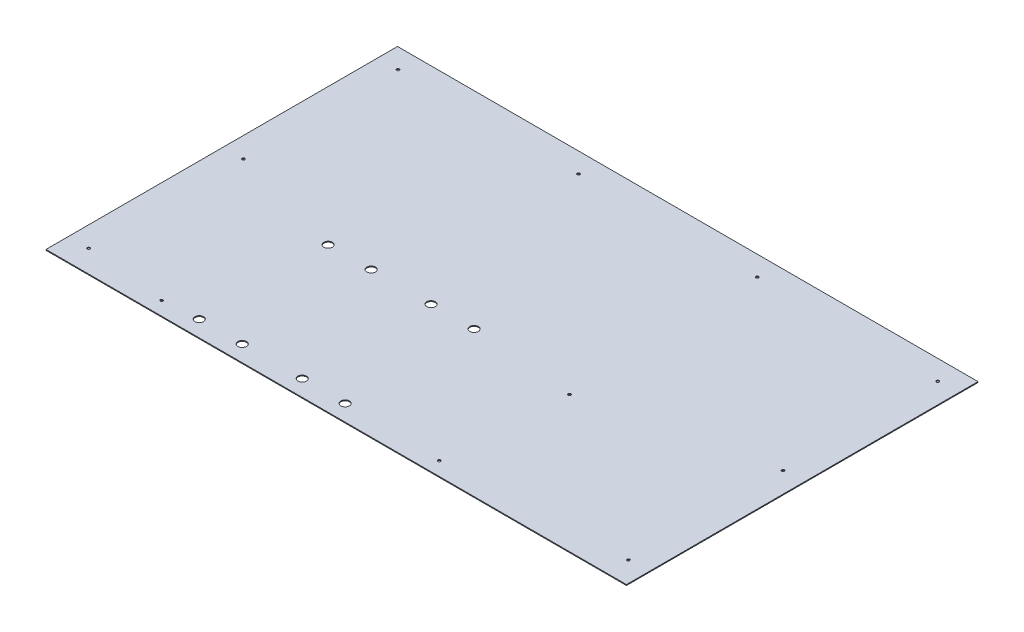
ISO-10303-21;
HEADER;
FILE_DESCRIPTION(('STEP AP214'),'2;1');
FILE_NAME('part.step','',(''),(''),'','','');
FILE_SCHEMA(('AUTOMOTIVE_DESIGN { 1 0 10303 214 1 1 1 1 }'));
ENDSEC;
DATA;
#1=APPLICATION_CONTEXT('core data for automotive mechanical design processes');
#2=APPLICATION_PROTOCOL_DEFINITION('international standard','automotive_design',2000,#1);
#3=PRODUCT_CONTEXT('',#1,'mechanical');
#4=PRODUCT('Part','Part','',(#3));
#5=PRODUCT_RELATED_PRODUCT_CATEGORY('part','',(#4));
#6=PRODUCT_DEFINITION_FORMATION('','',#4);
#7=PRODUCT_DEFINITION_CONTEXT('part definition',#1,'design');
#8=PRODUCT_DEFINITION('design','',#6,#7);
#9=PRODUCT_DEFINITION_SHAPE('','',#8);
#10=(LENGTH_UNIT() NAMED_UNIT(*) SI_UNIT(.MILLI.,.METRE.));
#11=(NAMED_UNIT(*) PLANE_ANGLE_UNIT() SI_UNIT($,.RADIAN.));
#12=(NAMED_UNIT(*) SI_UNIT($,.STERADIAN.) SOLID_ANGLE_UNIT());
#13=UNCERTAINTY_MEASURE_WITH_UNIT(LENGTH_MEASURE(1.E-05),#10,'distance_accuracy_value','');
#14=(GEOMETRIC_REPRESENTATION_CONTEXT(3) GLOBAL_UNCERTAINTY_ASSIGNED_CONTEXT((#13)) GLOBAL_UNIT_ASSIGNED_CONTEXT((#10,
#11,#12)) REPRESENTATION_CONTEXT('',''));
#15=CARTESIAN_POINT('',(0.,0.,0.));
#16=DIRECTION('',(0.,0.,1.));
#17=DIRECTION('',(1.,0.,0.));
#18=AXIS2_PLACEMENT_3D('',#15,#16,#17);
#19=CARTESIAN_POINT('',(337.7,1.,204.5));
#20=DIRECTION('',(-1.,0.,0.));
#21=DIRECTION('',(0.,0.,1.));
#22=AXIS2_PLACEMENT_3D('',#19,#20,#21);
#23=PLANE('',#22);
#24=DIRECTION('',(0.,0.,-1.));
#25=VECTOR('',#24,1.);
#26=CARTESIAN_POINT('',(337.7,0.,204.5));
#27=LINE('',#26,#25);
#28=CARTESIAN_POINT('',(337.7,0.,204.5));
#29=VERTEX_POINT('',#28);
#30=CARTESIAN_POINT('',(337.7,0.,-204.5));
#31=VERTEX_POINT('',#30);
#32=EDGE_CURVE('E96',#29,#31,#27,.T.);
#33=ORIENTED_EDGE('',*,*,#32,.T.);
#34=DIRECTION('',(0.,-1.,0.));
#35=VECTOR('',#34,1.);
#36=CARTESIAN_POINT('',(337.7,1.,-204.5));
#37=LINE('',#36,#35);
#38=CARTESIAN_POINT('',(337.7,1.,-204.5));
#39=VERTEX_POINT('',#38);
#40=EDGE_CURVE('E11',#39,#31,#37,.T.);
#41=ORIENTED_EDGE('',*,*,#40,.F.);
#42=DIRECTION('',(0.,0.,-1.));
#43=VECTOR('',#42,1.);
#44=CARTESIAN_POINT('',(337.7,1.,204.5));
#45=LINE('',#44,#43);
#46=CARTESIAN_POINT('',(337.7,1.,204.5));
#47=VERTEX_POINT('',#46);
#48=EDGE_CURVE('E84',#47,#39,#45,.T.);
#49=ORIENTED_EDGE('',*,*,#48,.F.);
#50=DIRECTION('',(0.,-1.,0.));
#51=VECTOR('',#50,1.);
#52=CARTESIAN_POINT('',(337.7,1.,204.5));
#53=LINE('',#52,#51);
#54=EDGE_CURVE('E92',#47,#29,#53,.T.);
#55=ORIENTED_EDGE('',*,*,#54,.T.);
#56=EDGE_LOOP('',(#33,#41,#49,#55));
#57=FACE_BOUND('',#56,.T.);
#58=ADVANCED_FACE('F33',(#57),#23,.F.);
#59=CARTESIAN_POINT('',(-337.7,1.,-204.5));
#60=DIRECTION('',(0.,0.,1.));
#61=DIRECTION('',(1.,0.,0.));
#62=AXIS2_PLACEMENT_3D('',#59,#60,#61);
#63=PLANE('',#62);
#64=DIRECTION('',(-1.,0.,0.));
#65=VECTOR('',#64,1.);
#66=CARTESIAN_POINT('',(-337.7,0.,-204.5));
#67=LINE('',#66,#65);
#68=CARTESIAN_POINT('',(-337.7,0.,-204.5));
#69=VERTEX_POINT('',#68);
#70=EDGE_CURVE('E88',#31,#69,#67,.T.);
#71=ORIENTED_EDGE('',*,*,#70,.T.);
#72=DIRECTION('',(0.,-1.,0.));
#73=VECTOR('',#72,1.);
#74=CARTESIAN_POINT('',(-337.7,1.,-204.5));
#75=LINE('',#74,#73);
#76=CARTESIAN_POINT('',(-337.7,1.,-204.5));
#77=VERTEX_POINT('',#76);
#78=EDGE_CURVE('E41',#77,#69,#75,.T.);
#79=ORIENTED_EDGE('',*,*,#78,.F.);
#80=DIRECTION('',(-1.,0.,0.));
#81=VECTOR('',#80,1.);
#82=CARTESIAN_POINT('',(-337.7,1.,-204.5));
#83=LINE('',#82,#81);
#84=EDGE_CURVE('E79',#39,#77,#83,.T.);
#85=ORIENTED_EDGE('',*,*,#84,.F.);
#86=ORIENTED_EDGE('',*,*,#40,.T.);
#87=EDGE_LOOP('',(#71,#79,#85,#86));
#88=FACE_BOUND('',#87,.T.);
#89=ADVANCED_FACE('F87',(#88),#63,.F.);
#90=CARTESIAN_POINT('',(-337.7,1.,204.5));
#91=DIRECTION('',(1.,0.,0.));
#92=DIRECTION('',(0.,0.,-1.));
#93=AXIS2_PLACEMENT_3D('',#90,#91,#92);
#94=PLANE('',#93);
#95=DIRECTION('',(0.,0.,1.));
#96=VECTOR('',#95,1.);
#97=CARTESIAN_POINT('',(-337.7,0.,204.5));
#98=LINE('',#97,#96);
#99=CARTESIAN_POINT('',(-337.7,0.,204.5));
#100=VERTEX_POINT('',#99);
#101=EDGE_CURVE('E66',#69,#100,#98,.T.);
#102=ORIENTED_EDGE('',*,*,#101,.T.);
#103=DIRECTION('',(0.,-1.,0.));
#104=VECTOR('',#103,1.);
#105=CARTESIAN_POINT('',(-337.7,1.,204.5));
#106=LINE('',#105,#104);
#107=CARTESIAN_POINT('',(-337.7,1.,204.5));
#108=VERTEX_POINT('',#107);
#109=EDGE_CURVE('E89',#108,#100,#106,.T.);
#110=ORIENTED_EDGE('',*,*,#109,.F.);
#111=DIRECTION('',(0.,0.,1.));
#112=VECTOR('',#111,1.);
#113=CARTESIAN_POINT('',(-337.7,1.,204.5));
#114=LINE('',#113,#112);
#115=EDGE_CURVE('E82',#77,#108,#114,.T.);
#116=ORIENTED_EDGE('',*,*,#115,.F.);
#117=ORIENTED_EDGE('',*,*,#78,.T.);
#118=EDGE_LOOP('',(#102,#110,#116,#117));
#119=FACE_BOUND('',#118,.T.);
#120=ADVANCED_FACE('F90',(#119),#94,.F.);
#121=CARTESIAN_POINT('',(-337.7,1.,204.5));
#122=DIRECTION('',(0.,0.,-1.));
#123=DIRECTION('',(-1.,0.,0.));
#124=AXIS2_PLACEMENT_3D('',#121,#122,#123);
#125=PLANE('',#124);
#126=DIRECTION('',(1.,0.,0.));
#127=VECTOR('',#126,1.);
#128=CARTESIAN_POINT('',(-337.7,0.,204.5));
#129=LINE('',#128,#127);
#130=EDGE_CURVE('E72',#100,#29,#129,.T.);
#131=ORIENTED_EDGE('',*,*,#130,.T.);
#132=ORIENTED_EDGE('',*,*,#54,.F.);
#133=DIRECTION('',(1.,0.,0.));
#134=VECTOR('',#133,1.);
#135=CARTESIAN_POINT('',(-337.7,1.,204.5));
#136=LINE('',#135,#134);
#137=EDGE_CURVE('E49',#108,#47,#136,.T.);
#138=ORIENTED_EDGE('',*,*,#137,.F.);
#139=ORIENTED_EDGE('',*,*,#109,.T.);
#140=EDGE_LOOP('',(#131,#132,#138,#139));
#141=FACE_BOUND('',#140,.T.);
#142=ADVANCED_FACE('F104',(#141),#125,.F.);
#143=CARTESIAN_POINT('',(0.,1.,0.));
#144=DIRECTION('',(0.,-1.,0.));
#145=DIRECTION('',(0.,0.,-1.));
#146=AXIS2_PLACEMENT_3D('',#143,#144,#145);
#147=PLANE('',#146);
#148=CARTESIAN_POINT('',(-104.,1.,-181.4));
#149=DIRECTION('',(0.,-1.,0.));
#150=DIRECTION('',(0.,0.,-1.));
#151=AXIS2_PLACEMENT_3D('',#148,#149,#150);
#152=CIRCLE('',#151,1.59999999999996);
#153=CARTESIAN_POINT('',(-104.,1.,-183.));
#154=VERTEX_POINT('',#153);
#155=EDGE_CURVE('E217',#154,#154,#152,.F.);
#156=ORIENTED_EDGE('',*,*,#155,.F.);
#157=EDGE_LOOP('',(#156));
#158=FACE_BOUND('',#157,.T.);
#159=CARTESIAN_POINT('',(104.,1.,188.6));
#160=DIRECTION('',(0.,-1.,0.));
#161=DIRECTION('',(0.,0.,-1.));
#162=AXIS2_PLACEMENT_3D('',#159,#160,#161);
#163=CIRCLE('',#162,1.60000000000002);
#164=CARTESIAN_POINT('',(104.,1.,187.));
#165=VERTEX_POINT('',#164);
#166=EDGE_CURVE('E211',#165,#165,#163,.F.);
#167=ORIENTED_EDGE('',*,*,#166,.F.);
#168=EDGE_LOOP('',(#167));
#169=FACE_BOUND('',#168,.T.);
#170=CARTESIAN_POINT('',(104.,1.,-181.4));
#171=DIRECTION('',(0.,-1.,0.));
#172=DIRECTION('',(0.,0.,-1.));
#173=AXIS2_PLACEMENT_3D('',#170,#171,#172);
#174=CIRCLE('',#173,1.59999999999999);
#175=CARTESIAN_POINT('',(104.,1.,-183.));
#176=VERTEX_POINT('',#175);
#177=EDGE_CURVE('E205',#176,#176,#174,.F.);
#178=ORIENTED_EDGE('',*,*,#177,.F.);
#179=EDGE_LOOP('',(#178));
#180=FACE_BOUND('',#179,.T.);
#181=CARTESIAN_POINT('',(-219.,1.,188.6));
#182=DIRECTION('',(0.,-1.,0.));
#183=DIRECTION('',(0.,0.,-1.));
#184=AXIS2_PLACEMENT_3D('',#181,#182,#183);
#185=CIRCLE('',#184,1.59999999999999);
#186=CARTESIAN_POINT('',(-219.,1.,187.));
#187=VERTEX_POINT('',#186);
#188=EDGE_CURVE('E199',#187,#187,#185,.F.);
#189=ORIENTED_EDGE('',*,*,#188,.F.);
#190=EDGE_LOOP('',(#189));
#191=FACE_BOUND('',#190,.T.);
#192=CARTESIAN_POINT('',(314.,1.,-1.3999999999999));
#193=DIRECTION('',(0.,-1.,0.));
#194=DIRECTION('',(0.,0.,-1.));
#195=AXIS2_PLACEMENT_3D('',#192,#193,#194);
#196=CIRCLE('',#195,1.59999999999996);
#197=CARTESIAN_POINT('',(314.,1.,-2.99999999999987));
#198=VERTEX_POINT('',#197);
#199=EDGE_CURVE('E193',#198,#198,#196,.F.);
#200=ORIENTED_EDGE('',*,*,#199,.F.);
#201=EDGE_LOOP('',(#200));
#202=FACE_BOUND('',#201,.T.);
#203=CARTESIAN_POINT('',(-314.,1.,-1.40000000000004));
#204=DIRECTION('',(0.,-1.,0.));
#205=DIRECTION('',(0.,0.,-1.));
#206=AXIS2_PLACEMENT_3D('',#203,#204,#205);
#207=CIRCLE('',#206,1.59999999999996);
#208=CARTESIAN_POINT('',(-314.,1.,-3.));
#209=VERTEX_POINT('',#208);
#210=EDGE_CURVE('E187',#209,#209,#207,.F.);
#211=ORIENTED_EDGE('',*,*,#210,.F.);
#212=EDGE_LOOP('',(#211));
#213=FACE_BOUND('',#212,.T.);
#214=CARTESIAN_POINT('',(-128.3,1.,35.6));
#215=DIRECTION('',(0.,-1.,0.));
#216=DIRECTION('',(0.,0.,-1.));
#217=AXIS2_PLACEMENT_3D('',#214,#215,#216);
#218=CIRCLE('',#217,4.99999999999999);
#219=CARTESIAN_POINT('',(-128.3,1.,30.6));
#220=VERTEX_POINT('',#219);
#221=EDGE_CURVE('E181',#220,#220,#218,.F.);
#222=ORIENTED_EDGE('',*,*,#221,.F.);
#223=EDGE_LOOP('',(#222));
#224=FACE_BOUND('',#223,.T.);
#225=CARTESIAN_POINT('',(-178.3,1.,35.6));
#226=DIRECTION('',(0.,-1.,0.));
#227=DIRECTION('',(0.,0.,-1.));
#228=AXIS2_PLACEMENT_3D('',#225,#226,#227);
#229=CIRCLE('',#228,4.99999999999999);
#230=CARTESIAN_POINT('',(-178.3,1.,30.6));
#231=VERTEX_POINT('',#230);
#232=EDGE_CURVE('E175',#231,#231,#229,.F.);
#233=ORIENTED_EDGE('',*,*,#232,.F.);
#234=EDGE_LOOP('',(#233));
#235=FACE_BOUND('',#234,.T.);
#236=CARTESIAN_POINT('',(-178.3,1.,185.6));
#237=DIRECTION('',(0.,-1.,0.));
#238=DIRECTION('',(0.,0.,-1.));
#239=AXIS2_PLACEMENT_3D('',#236,#237,#238);
#240=CIRCLE('',#239,4.99999999999999);
#241=CARTESIAN_POINT('',(-178.3,1.,180.6));
#242=VERTEX_POINT('',#241);
#243=EDGE_CURVE('E169',#242,#242,#240,.F.);
#244=ORIENTED_EDGE('',*,*,#243,.F.);
#245=EDGE_LOOP('',(#244));
#246=FACE_BOUND('',#245,.T.);
#247=CARTESIAN_POINT('',(-128.3,1.,185.6));
#248=DIRECTION('',(0.,-1.,0.));
#249=DIRECTION('',(0.,0.,-1.));
#250=AXIS2_PLACEMENT_3D('',#247,#248,#249);
#251=CIRCLE('',#250,5.00000000000002);
#252=CARTESIAN_POINT('',(-128.3,1.,180.6));
#253=VERTEX_POINT('',#252);
#254=EDGE_CURVE('E163',#253,#253,#251,.F.);
#255=ORIENTED_EDGE('',*,*,#254,.F.);
#256=EDGE_LOOP('',(#255));
#257=FACE_BOUND('',#256,.T.);
#258=CARTESIAN_POINT('',(-58.5,1.,185.6));
#259=DIRECTION('',(0.,-1.,0.));
#260=DIRECTION('',(0.,0.,-1.));
#261=AXIS2_PLACEMENT_3D('',#258,#259,#260);
#262=CIRCLE('',#261,5.00000000000002);
#263=CARTESIAN_POINT('',(-58.5,1.,180.6));
#264=VERTEX_POINT('',#263);
#265=EDGE_CURVE('E157',#264,#264,#262,.F.);
#266=ORIENTED_EDGE('',*,*,#265,.F.);
#267=EDGE_LOOP('',(#266));
#268=FACE_BOUND('',#267,.T.);
#269=CARTESIAN_POINT('',(-8.49999999999999,1.,185.6));
#270=DIRECTION('',(0.,-1.,0.));
#271=DIRECTION('',(0.,0.,-1.));
#272=AXIS2_PLACEMENT_3D('',#269,#270,#271);
#273=CIRCLE('',#272,5.00000000000001);
#274=CARTESIAN_POINT('',(-8.49999999999999,1.,180.6));
#275=VERTEX_POINT('',#274);
#276=EDGE_CURVE('E151',#275,#275,#273,.F.);
#277=ORIENTED_EDGE('',*,*,#276,.F.);
#278=EDGE_LOOP('',(#277));
#279=FACE_BOUND('',#278,.T.);
#280=CARTESIAN_POINT('',(-8.49999999999999,1.,35.6));
#281=DIRECTION('',(0.,-1.,0.));
#282=DIRECTION('',(0.,0.,-1.));
#283=AXIS2_PLACEMENT_3D('',#280,#281,#282);
#284=CIRCLE('',#283,4.99999999999999);
#285=CARTESIAN_POINT('',(-8.49999999999999,1.,30.6));
#286=VERTEX_POINT('',#285);
#287=EDGE_CURVE('E145',#286,#286,#284,.F.);
#288=ORIENTED_EDGE('',*,*,#287,.F.);
#289=EDGE_LOOP('',(#288));
#290=FACE_BOUND('',#289,.T.);
#291=CARTESIAN_POINT('',(-58.5,1.,35.6));
#292=DIRECTION('',(0.,-1.,0.));
#293=DIRECTION('',(0.,0.,-1.));
#294=AXIS2_PLACEMENT_3D('',#291,#292,#293);
#295=CIRCLE('',#294,4.99999999999999);
#296=CARTESIAN_POINT('',(-58.5,1.,30.6));
#297=VERTEX_POINT('',#296);
#298=EDGE_CURVE('E139',#297,#297,#295,.F.);
#299=ORIENTED_EDGE('',*,*,#298,.F.);
#300=EDGE_LOOP('',(#299));
#301=FACE_BOUND('',#300,.T.);
#302=CARTESIAN_POINT('',(113.,1.,46.25));
#303=DIRECTION('',(0.,-1.,0.));
#304=DIRECTION('',(0.,0.,-1.));
#305=AXIS2_PLACEMENT_3D('',#302,#303,#304);
#306=CIRCLE('',#305,1.60000000000001);
#307=CARTESIAN_POINT('',(113.,1.,44.65));
#308=VERTEX_POINT('',#307);
#309=EDGE_CURVE('E133',#308,#308,#306,.F.);
#310=ORIENTED_EDGE('',*,*,#309,.F.);
#311=EDGE_LOOP('',(#310));
#312=FACE_BOUND('',#311,.T.);
#313=CARTESIAN_POINT('',(314.,1.,178.6));
#314=DIRECTION('',(0.,-1.,0.));
#315=DIRECTION('',(0.,0.,-1.));
#316=AXIS2_PLACEMENT_3D('',#313,#314,#315);
#317=CIRCLE('',#316,1.59999999999996);
#318=CARTESIAN_POINT('',(314.,1.,177.));
#319=VERTEX_POINT('',#318);
#320=EDGE_CURVE('E127',#319,#319,#317,.F.);
#321=ORIENTED_EDGE('',*,*,#320,.F.);
#322=EDGE_LOOP('',(#321));
#323=FACE_BOUND('',#322,.T.);
#324=CARTESIAN_POINT('',(314.,1.,-181.4));
#325=DIRECTION('',(0.,-1.,0.));
#326=DIRECTION('',(0.,0.,-1.));
#327=AXIS2_PLACEMENT_3D('',#324,#325,#326);
#328=CIRCLE('',#327,1.59999999999996);
#329=CARTESIAN_POINT('',(314.,1.,-183.));
#330=VERTEX_POINT('',#329);
#331=EDGE_CURVE('E121',#330,#330,#328,.F.);
#332=ORIENTED_EDGE('',*,*,#331,.F.);
#333=EDGE_LOOP('',(#332));
#334=FACE_BOUND('',#333,.T.);
#335=CARTESIAN_POINT('',(-314.,1.,-181.4));
#336=DIRECTION('',(0.,-1.,0.));
#337=DIRECTION('',(0.,0.,-1.));
#338=AXIS2_PLACEMENT_3D('',#335,#336,#337);
#339=CIRCLE('',#338,1.59999999999996);
#340=CARTESIAN_POINT('',(-314.,1.,-183.));
#341=VERTEX_POINT('',#340);
#342=EDGE_CURVE('E115',#341,#341,#339,.F.);
#343=ORIENTED_EDGE('',*,*,#342,.F.);
#344=EDGE_LOOP('',(#343));
#345=FACE_BOUND('',#344,.T.);
#346=CARTESIAN_POINT('',(-314.,1.,178.6));
#347=DIRECTION('',(0.,-1.,0.));
#348=DIRECTION('',(0.,0.,-1.));
#349=AXIS2_PLACEMENT_3D('',#346,#347,#348);
#350=CIRCLE('',#349,1.59999999999996);
#351=CARTESIAN_POINT('',(-314.,1.,177.));
#352=VERTEX_POINT('',#351);
#353=EDGE_CURVE('E99',#352,#352,#350,.F.);
#354=ORIENTED_EDGE('',*,*,#353,.F.);
#355=EDGE_LOOP('',(#354));
#356=FACE_BOUND('',#355,.T.);
#357=ORIENTED_EDGE('',*,*,#48,.T.);
#358=ORIENTED_EDGE('',*,*,#84,.T.);
#359=ORIENTED_EDGE('',*,*,#115,.T.);
#360=ORIENTED_EDGE('',*,*,#137,.T.);
#361=EDGE_LOOP('',(#357,#358,#359,#360));
#362=FACE_BOUND('',#361,.T.);
#363=ADVANCED_FACE('F80',(#158,#169,#180,#191,#202,#213,#224,#235,#246,#257,#268,#279,#290,#301,
#312,#323,#334,#345,#356,#362),#147,.F.);
#364=CARTESIAN_POINT('',(0.,0.,0.));
#365=DIRECTION('',(0.,-1.,0.));
#366=DIRECTION('',(0.,0.,-1.));
#367=AXIS2_PLACEMENT_3D('',#364,#365,#366);
#368=PLANE('',#367);
#369=CARTESIAN_POINT('',(-104.,0.,-181.4));
#370=DIRECTION('',(0.,-1.,0.));
#371=DIRECTION('',(0.,0.,-1.));
#372=AXIS2_PLACEMENT_3D('',#369,#370,#371);
#373=CIRCLE('',#372,1.59999999999996);
#374=CARTESIAN_POINT('',(-104.,0.,-183.));
#375=VERTEX_POINT('',#374);
#376=EDGE_CURVE('E220',#375,#375,#373,.T.);
#377=ORIENTED_EDGE('',*,*,#376,.F.);
#378=EDGE_LOOP('',(#377));
#379=FACE_BOUND('',#378,.T.);
#380=CARTESIAN_POINT('',(104.,0.,188.6));
#381=DIRECTION('',(0.,-1.,0.));
#382=DIRECTION('',(0.,0.,-1.));
#383=AXIS2_PLACEMENT_3D('',#380,#381,#382);
#384=CIRCLE('',#383,1.60000000000002);
#385=CARTESIAN_POINT('',(104.,0.,187.));
#386=VERTEX_POINT('',#385);
#387=EDGE_CURVE('E214',#386,#386,#384,.T.);
#388=ORIENTED_EDGE('',*,*,#387,.F.);
#389=EDGE_LOOP('',(#388));
#390=FACE_BOUND('',#389,.T.);
#391=CARTESIAN_POINT('',(104.,0.,-181.4));
#392=DIRECTION('',(0.,-1.,0.));
#393=DIRECTION('',(0.,0.,-1.));
#394=AXIS2_PLACEMENT_3D('',#391,#392,#393);
#395=CIRCLE('',#394,1.59999999999999);
#396=CARTESIAN_POINT('',(104.,0.,-183.));
#397=VERTEX_POINT('',#396);
#398=EDGE_CURVE('E208',#397,#397,#395,.T.);
#399=ORIENTED_EDGE('',*,*,#398,.F.);
#400=EDGE_LOOP('',(#399));
#401=FACE_BOUND('',#400,.T.);
#402=CARTESIAN_POINT('',(-219.,0.,188.6));
#403=DIRECTION('',(0.,-1.,0.));
#404=DIRECTION('',(0.,0.,-1.));
#405=AXIS2_PLACEMENT_3D('',#402,#403,#404);
#406=CIRCLE('',#405,1.59999999999999);
#407=CARTESIAN_POINT('',(-219.,0.,187.));
#408=VERTEX_POINT('',#407);
#409=EDGE_CURVE('E202',#408,#408,#406,.T.);
#410=ORIENTED_EDGE('',*,*,#409,.F.);
#411=EDGE_LOOP('',(#410));
#412=FACE_BOUND('',#411,.T.);
#413=CARTESIAN_POINT('',(314.,0.,-1.3999999999999));
#414=DIRECTION('',(0.,-1.,0.));
#415=DIRECTION('',(0.,0.,-1.));
#416=AXIS2_PLACEMENT_3D('',#413,#414,#415);
#417=CIRCLE('',#416,1.59999999999996);
#418=CARTESIAN_POINT('',(314.,0.,-2.99999999999987));
#419=VERTEX_POINT('',#418);
#420=EDGE_CURVE('E196',#419,#419,#417,.T.);
#421=ORIENTED_EDGE('',*,*,#420,.F.);
#422=EDGE_LOOP('',(#421));
#423=FACE_BOUND('',#422,.T.);
#424=CARTESIAN_POINT('',(-314.,0.,-1.40000000000004));
#425=DIRECTION('',(0.,-1.,0.));
#426=DIRECTION('',(0.,0.,-1.));
#427=AXIS2_PLACEMENT_3D('',#424,#425,#426);
#428=CIRCLE('',#427,1.59999999999996);
#429=CARTESIAN_POINT('',(-314.,0.,-3.));
#430=VERTEX_POINT('',#429);
#431=EDGE_CURVE('E190',#430,#430,#428,.T.);
#432=ORIENTED_EDGE('',*,*,#431,.F.);
#433=EDGE_LOOP('',(#432));
#434=FACE_BOUND('',#433,.T.);
#435=CARTESIAN_POINT('',(-128.3,0.,35.6));
#436=DIRECTION('',(0.,-1.,0.));
#437=DIRECTION('',(0.,0.,1.));
#438=AXIS2_PLACEMENT_3D('',#435,#436,#437);
#439=CIRCLE('',#438,4.99999999999999);
#440=CARTESIAN_POINT('',(-128.3,0.,40.6));
#441=VERTEX_POINT('',#440);
#442=EDGE_CURVE('E184',#441,#441,#439,.T.);
#443=ORIENTED_EDGE('',*,*,#442,.F.);
#444=EDGE_LOOP('',(#443));
#445=FACE_BOUND('',#444,.T.);
#446=CARTESIAN_POINT('',(-178.3,0.,35.6));
#447=DIRECTION('',(0.,-1.,0.));
#448=DIRECTION('',(0.,0.,1.));
#449=AXIS2_PLACEMENT_3D('',#446,#447,#448);
#450=CIRCLE('',#449,4.99999999999999);
#451=CARTESIAN_POINT('',(-178.3,0.,40.6));
#452=VERTEX_POINT('',#451);
#453=EDGE_CURVE('E178',#452,#452,#450,.T.);
#454=ORIENTED_EDGE('',*,*,#453,.F.);
#455=EDGE_LOOP('',(#454));
#456=FACE_BOUND('',#455,.T.);
#457=CARTESIAN_POINT('',(-178.3,0.,185.6));
#458=DIRECTION('',(0.,-1.,0.));
#459=DIRECTION('',(0.,0.,1.));
#460=AXIS2_PLACEMENT_3D('',#457,#458,#459);
#461=CIRCLE('',#460,4.99999999999999);
#462=CARTESIAN_POINT('',(-178.3,0.,190.6));
#463=VERTEX_POINT('',#462);
#464=EDGE_CURVE('E172',#463,#463,#461,.T.);
#465=ORIENTED_EDGE('',*,*,#464,.F.);
#466=EDGE_LOOP('',(#465));
#467=FACE_BOUND('',#466,.T.);
#468=CARTESIAN_POINT('',(-128.3,0.,185.6));
#469=DIRECTION('',(0.,-1.,0.));
#470=DIRECTION('',(0.,0.,1.));
#471=AXIS2_PLACEMENT_3D('',#468,#469,#470);
#472=CIRCLE('',#471,5.00000000000002);
#473=CARTESIAN_POINT('',(-128.3,0.,190.6));
#474=VERTEX_POINT('',#473);
#475=EDGE_CURVE('E166',#474,#474,#472,.T.);
#476=ORIENTED_EDGE('',*,*,#475,.F.);
#477=EDGE_LOOP('',(#476));
#478=FACE_BOUND('',#477,.T.);
#479=CARTESIAN_POINT('',(-58.5,0.,185.6));
#480=DIRECTION('',(0.,-1.,0.));
#481=DIRECTION('',(0.,0.,-1.));
#482=AXIS2_PLACEMENT_3D('',#479,#480,#481);
#483=CIRCLE('',#482,5.00000000000002);
#484=CARTESIAN_POINT('',(-58.5,0.,180.6));
#485=VERTEX_POINT('',#484);
#486=EDGE_CURVE('E160',#485,#485,#483,.T.);
#487=ORIENTED_EDGE('',*,*,#486,.F.);
#488=EDGE_LOOP('',(#487));
#489=FACE_BOUND('',#488,.T.);
#490=CARTESIAN_POINT('',(-8.49999999999999,0.,185.6));
#491=DIRECTION('',(0.,-1.,0.));
#492=DIRECTION('',(0.,0.,-1.));
#493=AXIS2_PLACEMENT_3D('',#490,#491,#492);
#494=CIRCLE('',#493,5.00000000000001);
#495=CARTESIAN_POINT('',(-8.49999999999999,0.,180.6));
#496=VERTEX_POINT('',#495);
#497=EDGE_CURVE('E154',#496,#496,#494,.T.);
#498=ORIENTED_EDGE('',*,*,#497,.F.);
#499=EDGE_LOOP('',(#498));
#500=FACE_BOUND('',#499,.T.);
#501=CARTESIAN_POINT('',(-8.49999999999999,0.,35.6));
#502=DIRECTION('',(0.,-1.,0.));
#503=DIRECTION('',(0.,0.,-1.));
#504=AXIS2_PLACEMENT_3D('',#501,#502,#503);
#505=CIRCLE('',#504,4.99999999999999);
#506=CARTESIAN_POINT('',(-8.49999999999999,0.,30.6));
#507=VERTEX_POINT('',#506);
#508=EDGE_CURVE('E148',#507,#507,#505,.T.);
#509=ORIENTED_EDGE('',*,*,#508,.F.);
#510=EDGE_LOOP('',(#509));
#511=FACE_BOUND('',#510,.T.);
#512=CARTESIAN_POINT('',(-58.5,0.,35.6));
#513=DIRECTION('',(0.,-1.,0.));
#514=DIRECTION('',(0.,0.,-1.));
#515=AXIS2_PLACEMENT_3D('',#512,#513,#514);
#516=CIRCLE('',#515,4.99999999999999);
#517=CARTESIAN_POINT('',(-58.5,0.,30.6));
#518=VERTEX_POINT('',#517);
#519=EDGE_CURVE('E142',#518,#518,#516,.T.);
#520=ORIENTED_EDGE('',*,*,#519,.F.);
#521=EDGE_LOOP('',(#520));
#522=FACE_BOUND('',#521,.T.);
#523=CARTESIAN_POINT('',(113.,0.,46.25));
#524=DIRECTION('',(0.,-1.,0.));
#525=DIRECTION('',(0.,0.,-1.));
#526=AXIS2_PLACEMENT_3D('',#523,#524,#525);
#527=CIRCLE('',#526,1.60000000000001);
#528=CARTESIAN_POINT('',(113.,0.,44.65));
#529=VERTEX_POINT('',#528);
#530=EDGE_CURVE('E136',#529,#529,#527,.T.);
#531=ORIENTED_EDGE('',*,*,#530,.F.);
#532=EDGE_LOOP('',(#531));
#533=FACE_BOUND('',#532,.T.);
#534=CARTESIAN_POINT('',(314.,0.,178.6));
#535=DIRECTION('',(0.,-1.,0.));
#536=DIRECTION('',(0.,0.,-1.));
#537=AXIS2_PLACEMENT_3D('',#534,#535,#536);
#538=CIRCLE('',#537,1.59999999999996);
#539=CARTESIAN_POINT('',(314.,0.,177.));
#540=VERTEX_POINT('',#539);
#541=EDGE_CURVE('E130',#540,#540,#538,.T.);
#542=ORIENTED_EDGE('',*,*,#541,.F.);
#543=EDGE_LOOP('',(#542));
#544=FACE_BOUND('',#543,.T.);
#545=CARTESIAN_POINT('',(314.,0.,-181.4));
#546=DIRECTION('',(0.,-1.,0.));
#547=DIRECTION('',(0.,0.,-1.));
#548=AXIS2_PLACEMENT_3D('',#545,#546,#547);
#549=CIRCLE('',#548,1.59999999999996);
#550=CARTESIAN_POINT('',(314.,0.,-183.));
#551=VERTEX_POINT('',#550);
#552=EDGE_CURVE('E124',#551,#551,#549,.T.);
#553=ORIENTED_EDGE('',*,*,#552,.F.);
#554=EDGE_LOOP('',(#553));
#555=FACE_BOUND('',#554,.T.);
#556=CARTESIAN_POINT('',(-314.,0.,-181.4));
#557=DIRECTION('',(0.,-1.,0.));
#558=DIRECTION('',(0.,0.,-1.));
#559=AXIS2_PLACEMENT_3D('',#556,#557,#558);
#560=CIRCLE('',#559,1.59999999999996);
#561=CARTESIAN_POINT('',(-314.,0.,-183.));
#562=VERTEX_POINT('',#561);
#563=EDGE_CURVE('E118',#562,#562,#560,.T.);
#564=ORIENTED_EDGE('',*,*,#563,.F.);
#565=EDGE_LOOP('',(#564));
#566=FACE_BOUND('',#565,.T.);
#567=CARTESIAN_POINT('',(-314.,0.,178.6));
#568=DIRECTION('',(0.,-1.,0.));
#569=DIRECTION('',(0.,0.,-1.));
#570=AXIS2_PLACEMENT_3D('',#567,#568,#569);
#571=CIRCLE('',#570,1.59999999999996);
#572=CARTESIAN_POINT('',(-314.,0.,177.));
#573=VERTEX_POINT('',#572);
#574=EDGE_CURVE('E112',#573,#573,#571,.T.);
#575=ORIENTED_EDGE('',*,*,#574,.F.);
#576=EDGE_LOOP('',(#575));
#577=FACE_BOUND('',#576,.T.);
#578=ORIENTED_EDGE('',*,*,#32,.F.);
#579=ORIENTED_EDGE('',*,*,#130,.F.);
#580=ORIENTED_EDGE('',*,*,#101,.F.);
#581=ORIENTED_EDGE('',*,*,#70,.F.);
#582=EDGE_LOOP('',(#578,#579,#580,#581));
#583=FACE_BOUND('',#582,.T.);
#584=ADVANCED_FACE('F107',(#379,#390,#401,#412,#423,#434,#445,#456,#467,#478,#489,#500,#511,
#522,#533,#544,#555,#566,#577,#583),#368,.T.);
#585=CARTESIAN_POINT('',(-314.,1.001,178.6));
#586=DIRECTION('',(0.,-1.,0.));
#587=DIRECTION('',(0.,0.,-1.));
#588=AXIS2_PLACEMENT_3D('',#585,#586,#587);
#589=CYLINDRICAL_SURFACE('',#588,1.59999999999996);
#590=ORIENTED_EDGE('',*,*,#574,.T.);
#591=EDGE_LOOP('',(#590));
#592=FACE_BOUND('',#591,.T.);
#593=ORIENTED_EDGE('',*,*,#353,.T.);
#594=EDGE_LOOP('',(#593));
#595=FACE_BOUND('',#594,.T.);
#596=ADVANCED_FACE('F229',(#592,#595),#589,.F.);
#597=CARTESIAN_POINT('',(-314.,1.001,-181.4));
#598=DIRECTION('',(0.,-1.,0.));
#599=DIRECTION('',(0.,0.,-1.));
#600=AXIS2_PLACEMENT_3D('',#597,#598,#599);
#601=CYLINDRICAL_SURFACE('',#600,1.59999999999996);
#602=ORIENTED_EDGE('',*,*,#563,.T.);
#603=EDGE_LOOP('',(#602));
#604=FACE_BOUND('',#603,.T.);
#605=ORIENTED_EDGE('',*,*,#342,.T.);
#606=EDGE_LOOP('',(#605));
#607=FACE_BOUND('',#606,.T.);
#608=ADVANCED_FACE('F269',(#604,#607),#601,.F.);
#609=CARTESIAN_POINT('',(314.,1.001,-181.4));
#610=DIRECTION('',(0.,-1.,0.));
#611=DIRECTION('',(0.,0.,-1.));
#612=AXIS2_PLACEMENT_3D('',#609,#610,#611);
#613=CYLINDRICAL_SURFACE('',#612,1.59999999999996);
#614=ORIENTED_EDGE('',*,*,#552,.T.);
#615=EDGE_LOOP('',(#614));
#616=FACE_BOUND('',#615,.T.);
#617=ORIENTED_EDGE('',*,*,#331,.T.);
#618=EDGE_LOOP('',(#617));
#619=FACE_BOUND('',#618,.T.);
#620=ADVANCED_FACE('F313',(#616,#619),#613,.F.);
#621=CARTESIAN_POINT('',(314.,1.001,178.6));
#622=DIRECTION('',(0.,-1.,0.));
#623=DIRECTION('',(0.,0.,-1.));
#624=AXIS2_PLACEMENT_3D('',#621,#622,#623);
#625=CYLINDRICAL_SURFACE('',#624,1.59999999999996);
#626=ORIENTED_EDGE('',*,*,#541,.T.);
#627=EDGE_LOOP('',(#626));
#628=FACE_BOUND('',#627,.T.);
#629=ORIENTED_EDGE('',*,*,#320,.T.);
#630=EDGE_LOOP('',(#629));
#631=FACE_BOUND('',#630,.T.);
#632=ADVANCED_FACE('F323',(#628,#631),#625,.F.);
#633=CARTESIAN_POINT('',(113.,1.001,46.25));
#634=DIRECTION('',(0.,-1.,0.));
#635=DIRECTION('',(0.,0.,-1.));
#636=AXIS2_PLACEMENT_3D('',#633,#634,#635);
#637=CYLINDRICAL_SURFACE('',#636,1.60000000000001);
#638=ORIENTED_EDGE('',*,*,#530,.T.);
#639=EDGE_LOOP('',(#638));
#640=FACE_BOUND('',#639,.T.);
#641=ORIENTED_EDGE('',*,*,#309,.T.);
#642=EDGE_LOOP('',(#641));
#643=FACE_BOUND('',#642,.T.);
#644=ADVANCED_FACE('F333',(#640,#643),#637,.F.);
#645=CARTESIAN_POINT('',(-58.5,1.001,35.6));
#646=DIRECTION('',(0.,-1.,0.));
#647=DIRECTION('',(0.,0.,-1.));
#648=AXIS2_PLACEMENT_3D('',#645,#646,#647);
#649=CYLINDRICAL_SURFACE('',#648,4.99999999999999);
#650=ORIENTED_EDGE('',*,*,#519,.T.);
#651=EDGE_LOOP('',(#650));
#652=FACE_BOUND('',#651,.T.);
#653=ORIENTED_EDGE('',*,*,#298,.T.);
#654=EDGE_LOOP('',(#653));
#655=FACE_BOUND('',#654,.T.);
#656=ADVANCED_FACE('F343',(#652,#655),#649,.F.);
#657=CARTESIAN_POINT('',(-8.49999999999999,1.001,35.6));
#658=DIRECTION('',(0.,-1.,0.));
#659=DIRECTION('',(0.,0.,-1.));
#660=AXIS2_PLACEMENT_3D('',#657,#658,#659);
#661=CYLINDRICAL_SURFACE('',#660,4.99999999999999);
#662=ORIENTED_EDGE('',*,*,#508,.T.);
#663=EDGE_LOOP('',(#662));
#664=FACE_BOUND('',#663,.T.);
#665=ORIENTED_EDGE('',*,*,#287,.T.);
#666=EDGE_LOOP('',(#665));
#667=FACE_BOUND('',#666,.T.);
#668=ADVANCED_FACE('F353',(#664,#667),#661,.F.);
#669=CARTESIAN_POINT('',(-8.49999999999999,1.001,185.6));
#670=DIRECTION('',(0.,-1.,0.));
#671=DIRECTION('',(0.,0.,-1.));
#672=AXIS2_PLACEMENT_3D('',#669,#670,#671);
#673=CYLINDRICAL_SURFACE('',#672,5.00000000000001);
#674=ORIENTED_EDGE('',*,*,#497,.T.);
#675=EDGE_LOOP('',(#674));
#676=FACE_BOUND('',#675,.T.);
#677=ORIENTED_EDGE('',*,*,#276,.T.);
#678=EDGE_LOOP('',(#677));
#679=FACE_BOUND('',#678,.T.);
#680=ADVANCED_FACE('F363',(#676,#679),#673,.F.);
#681=CARTESIAN_POINT('',(-58.5,1.001,185.6));
#682=DIRECTION('',(0.,-1.,0.));
#683=DIRECTION('',(0.,0.,-1.));
#684=AXIS2_PLACEMENT_3D('',#681,#682,#683);
#685=CYLINDRICAL_SURFACE('',#684,5.00000000000002);
#686=ORIENTED_EDGE('',*,*,#486,.T.);
#687=EDGE_LOOP('',(#686));
#688=FACE_BOUND('',#687,.T.);
#689=ORIENTED_EDGE('',*,*,#265,.T.);
#690=EDGE_LOOP('',(#689));
#691=FACE_BOUND('',#690,.T.);
#692=ADVANCED_FACE('F373',(#688,#691),#685,.F.);
#693=CARTESIAN_POINT('',(-128.3,1.001,185.6));
#694=DIRECTION('',(0.,-1.,0.));
#695=DIRECTION('',(0.,0.,-1.));
#696=AXIS2_PLACEMENT_3D('',#693,#694,#695);
#697=CYLINDRICAL_SURFACE('',#696,5.00000000000002);
#698=ORIENTED_EDGE('',*,*,#475,.T.);
#699=EDGE_LOOP('',(#698));
#700=FACE_BOUND('',#699,.T.);
#701=ORIENTED_EDGE('',*,*,#254,.T.);
#702=EDGE_LOOP('',(#701));
#703=FACE_BOUND('',#702,.T.);
#704=ADVANCED_FACE('F383',(#700,#703),#697,.F.);
#705=CARTESIAN_POINT('',(-178.3,1.001,185.6));
#706=DIRECTION('',(0.,-1.,0.));
#707=DIRECTION('',(0.,0.,-1.));
#708=AXIS2_PLACEMENT_3D('',#705,#706,#707);
#709=CYLINDRICAL_SURFACE('',#708,4.99999999999999);
#710=ORIENTED_EDGE('',*,*,#464,.T.);
#711=EDGE_LOOP('',(#710));
#712=FACE_BOUND('',#711,.T.);
#713=ORIENTED_EDGE('',*,*,#243,.T.);
#714=EDGE_LOOP('',(#713));
#715=FACE_BOUND('',#714,.T.);
#716=ADVANCED_FACE('F393',(#712,#715),#709,.F.);
#717=CARTESIAN_POINT('',(-178.3,1.001,35.6));
#718=DIRECTION('',(0.,-1.,0.));
#719=DIRECTION('',(0.,0.,-1.));
#720=AXIS2_PLACEMENT_3D('',#717,#718,#719);
#721=CYLINDRICAL_SURFACE('',#720,4.99999999999999);
#722=ORIENTED_EDGE('',*,*,#453,.T.);
#723=EDGE_LOOP('',(#722));
#724=FACE_BOUND('',#723,.T.);
#725=ORIENTED_EDGE('',*,*,#232,.T.);
#726=EDGE_LOOP('',(#725));
#727=FACE_BOUND('',#726,.T.);
#728=ADVANCED_FACE('F403',(#724,#727),#721,.F.);
#729=CARTESIAN_POINT('',(-128.3,1.001,35.6));
#730=DIRECTION('',(0.,-1.,0.));
#731=DIRECTION('',(0.,0.,-1.));
#732=AXIS2_PLACEMENT_3D('',#729,#730,#731);
#733=CYLINDRICAL_SURFACE('',#732,4.99999999999999);
#734=ORIENTED_EDGE('',*,*,#442,.T.);
#735=EDGE_LOOP('',(#734));
#736=FACE_BOUND('',#735,.T.);
#737=ORIENTED_EDGE('',*,*,#221,.T.);
#738=EDGE_LOOP('',(#737));
#739=FACE_BOUND('',#738,.T.);
#740=ADVANCED_FACE('F413',(#736,#739),#733,.F.);
#741=CARTESIAN_POINT('',(-314.,1.001,-1.40000000000004));
#742=DIRECTION('',(0.,-1.,0.));
#743=DIRECTION('',(0.,0.,-1.));
#744=AXIS2_PLACEMENT_3D('',#741,#742,#743);
#745=CYLINDRICAL_SURFACE('',#744,1.59999999999996);
#746=ORIENTED_EDGE('',*,*,#431,.T.);
#747=EDGE_LOOP('',(#746));
#748=FACE_BOUND('',#747,.T.);
#749=ORIENTED_EDGE('',*,*,#210,.T.);
#750=EDGE_LOOP('',(#749));
#751=FACE_BOUND('',#750,.T.);
#752=ADVANCED_FACE('F422',(#748,#751),#745,.F.);
#753=CARTESIAN_POINT('',(314.,1.001,-1.3999999999999));
#754=DIRECTION('',(0.,-1.,0.));
#755=DIRECTION('',(0.,0.,-1.));
#756=AXIS2_PLACEMENT_3D('',#753,#754,#755);
#757=CYLINDRICAL_SURFACE('',#756,1.59999999999996);
#758=ORIENTED_EDGE('',*,*,#420,.T.);
#759=EDGE_LOOP('',(#758));
#760=FACE_BOUND('',#759,.T.);
#761=ORIENTED_EDGE('',*,*,#199,.T.);
#762=EDGE_LOOP('',(#761));
#763=FACE_BOUND('',#762,.T.);
#764=ADVANCED_FACE('F441',(#760,#763),#757,.F.);
#765=CARTESIAN_POINT('',(-219.,1.001,188.6));
#766=DIRECTION('',(0.,-1.,0.));
#767=DIRECTION('',(0.,0.,-1.));
#768=AXIS2_PLACEMENT_3D('',#765,#766,#767);
#769=CYLINDRICAL_SURFACE('',#768,1.59999999999999);
#770=ORIENTED_EDGE('',*,*,#409,.T.);
#771=EDGE_LOOP('',(#770));
#772=FACE_BOUND('',#771,.T.);
#773=ORIENTED_EDGE('',*,*,#188,.T.);
#774=EDGE_LOOP('',(#773));
#775=FACE_BOUND('',#774,.T.);
#776=ADVANCED_FACE('F451',(#772,#775),#769,.F.);
#777=CARTESIAN_POINT('',(104.,1.001,-181.4));
#778=DIRECTION('',(0.,-1.,0.));
#779=DIRECTION('',(0.,0.,-1.));
#780=AXIS2_PLACEMENT_3D('',#777,#778,#779);
#781=CYLINDRICAL_SURFACE('',#780,1.59999999999999);
#782=ORIENTED_EDGE('',*,*,#398,.T.);
#783=EDGE_LOOP('',(#782));
#784=FACE_BOUND('',#783,.T.);
#785=ORIENTED_EDGE('',*,*,#177,.T.);
#786=EDGE_LOOP('',(#785));
#787=FACE_BOUND('',#786,.T.);
#788=ADVANCED_FACE('F461',(#784,#787),#781,.F.);
#789=CARTESIAN_POINT('',(104.,1.001,188.6));
#790=DIRECTION('',(0.,-1.,0.));
#791=DIRECTION('',(0.,0.,-1.));
#792=AXIS2_PLACEMENT_3D('',#789,#790,#791);
#793=CYLINDRICAL_SURFACE('',#792,1.60000000000002);
#794=ORIENTED_EDGE('',*,*,#387,.T.);
#795=EDGE_LOOP('',(#794));
#796=FACE_BOUND('',#795,.T.);
#797=ORIENTED_EDGE('',*,*,#166,.T.);
#798=EDGE_LOOP('',(#797));
#799=FACE_BOUND('',#798,.T.);
#800=ADVANCED_FACE('F471',(#796,#799),#793,.F.);
#801=CARTESIAN_POINT('',(-104.,1.001,-181.4));
#802=DIRECTION('',(0.,-1.,0.));
#803=DIRECTION('',(0.,0.,-1.));
#804=AXIS2_PLACEMENT_3D('',#801,#802,#803);
#805=CYLINDRICAL_SURFACE('',#804,1.59999999999996);
#806=ORIENTED_EDGE('',*,*,#376,.T.);
#807=EDGE_LOOP('',(#806));
#808=FACE_BOUND('',#807,.T.);
#809=ORIENTED_EDGE('',*,*,#155,.T.);
#810=EDGE_LOOP('',(#809));
#811=FACE_BOUND('',#810,.T.);
#812=ADVANCED_FACE('F224',(#808,#811),#805,.F.);
#813=CLOSED_SHELL('',(#58,#89,#120,#142,#363,#584,#596,#608,#620,#632,#644,#656,#668,#680,#692,
#704,#716,#728,#740,#752,#764,#776,#788,#800,#812));
#814=MANIFOLD_SOLID_BREP('B2',#813);
#815=ADVANCED_BREP_SHAPE_REPRESENTATION('',(#18,#814),#14);
#816=SHAPE_DEFINITION_REPRESENTATION(#9,#815);
ENDSEC;
END-ISO-10303-21;
